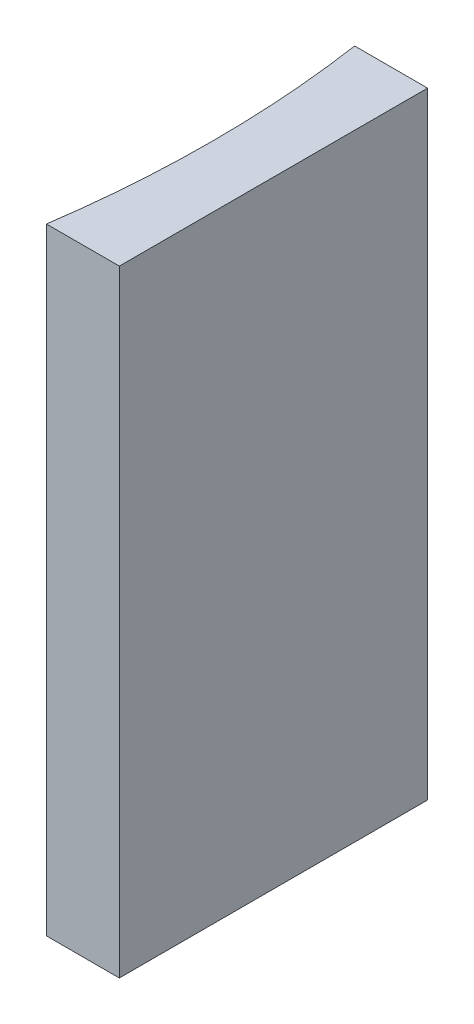
ISO-10303-21;
HEADER;
FILE_DESCRIPTION(('STEP AP214'),'2;1');
FILE_NAME('part.step','',(''),(''),'','','');
FILE_SCHEMA(('AUTOMOTIVE_DESIGN { 1 0 10303 214 1 1 1 1 }'));
ENDSEC;
DATA;
#1=APPLICATION_CONTEXT('core data for automotive mechanical design processes');
#2=APPLICATION_PROTOCOL_DEFINITION('international standard','automotive_design',2000,#1);
#3=PRODUCT_CONTEXT('',#1,'mechanical');
#4=PRODUCT('Part','Part','',(#3));
#5=PRODUCT_RELATED_PRODUCT_CATEGORY('part','',(#4));
#6=PRODUCT_DEFINITION_FORMATION('','',#4);
#7=PRODUCT_DEFINITION_CONTEXT('part definition',#1,'design');
#8=PRODUCT_DEFINITION('design','',#6,#7);
#9=PRODUCT_DEFINITION_SHAPE('','',#8);
#10=(LENGTH_UNIT() NAMED_UNIT(*) SI_UNIT(.MILLI.,.METRE.));
#11=(NAMED_UNIT(*) PLANE_ANGLE_UNIT() SI_UNIT($,.RADIAN.));
#12=(NAMED_UNIT(*) SI_UNIT($,.STERADIAN.) SOLID_ANGLE_UNIT());
#13=UNCERTAINTY_MEASURE_WITH_UNIT(LENGTH_MEASURE(1.E-05),#10,'distance_accuracy_value','');
#14=(GEOMETRIC_REPRESENTATION_CONTEXT(3) GLOBAL_UNCERTAINTY_ASSIGNED_CONTEXT((#13)) GLOBAL_UNIT_ASSIGNED_CONTEXT((#10,
#11,#12)) REPRESENTATION_CONTEXT('',''));
#15=CARTESIAN_POINT('',(0.,0.,0.));
#16=DIRECTION('',(0.,0.,1.));
#17=DIRECTION('',(1.,0.,0.));
#18=AXIS2_PLACEMENT_3D('',#15,#16,#17);
#19=CARTESIAN_POINT('',(0.,20.,0.));
#20=DIRECTION('',(0.,0.,1.));
#21=DIRECTION('',(1.,0.,0.));
#22=AXIS2_PLACEMENT_3D('',#19,#20,#21);
#23=PLANE('',#22);
#24=DIRECTION('',(-1.,0.,0.));
#25=VECTOR('',#24,1.);
#26=CARTESIAN_POINT('',(0.,0.,0.));
#27=LINE('',#26,#25);
#28=CARTESIAN_POINT('',(0.,0.,0.));
#29=VERTEX_POINT('',#28);
#30=CARTESIAN_POINT('',(-2.36584928234928,0.,0.));
#31=VERTEX_POINT('',#30);
#32=EDGE_CURVE('E98',#29,#31,#27,.T.);
#33=ORIENTED_EDGE('',*,*,#32,.T.);
#34=DIRECTION('',(0.,-1.,0.));
#35=VECTOR('',#34,1.);
#36=CARTESIAN_POINT('',(-2.36584928234928,20.,0.));
#37=LINE('',#36,#35);
#38=CARTESIAN_POINT('',(-2.36584928234928,20.,0.));
#39=VERTEX_POINT('',#38);
#40=EDGE_CURVE('E11',#39,#31,#37,.T.);
#41=ORIENTED_EDGE('',*,*,#40,.F.);
#42=DIRECTION('',(-1.,0.,0.));
#43=VECTOR('',#42,1.);
#44=CARTESIAN_POINT('',(0.,20.,0.));
#45=LINE('',#44,#43);
#46=CARTESIAN_POINT('',(0.,20.,0.));
#47=VERTEX_POINT('',#46);
#48=EDGE_CURVE('E86',#47,#39,#45,.T.);
#49=ORIENTED_EDGE('',*,*,#48,.F.);
#50=DIRECTION('',(0.,-1.,0.));
#51=VECTOR('',#50,1.);
#52=CARTESIAN_POINT('',(0.,20.,0.));
#53=LINE('',#52,#51);
#54=EDGE_CURVE('E94',#47,#29,#53,.T.);
#55=ORIENTED_EDGE('',*,*,#54,.T.);
#56=EDGE_LOOP('',(#33,#41,#49,#55));
#57=FACE_BOUND('',#56,.T.);
#58=ADVANCED_FACE('F35',(#57),#23,.F.);
#59=CARTESIAN_POINT('',(-36.35,20.,5.00000000000001));
#60=DIRECTION('',(0.,-1.,0.));
#61=DIRECTION('',(0.,0.,-1.));
#62=AXIS2_PLACEMENT_3D('',#59,#60,#61);
#63=CYLINDRICAL_SURFACE('',#62,34.35);
#64=CARTESIAN_POINT('',(-36.35,0.,5.00000000000001));
#65=DIRECTION('',(0.,-1.,0.));
#66=DIRECTION('',(0.,0.,1.));
#67=AXIS2_PLACEMENT_3D('',#64,#65,#66);
#68=CIRCLE('',#67,34.35);
#69=CARTESIAN_POINT('',(-2.36584928234928,0.,10.));
#70=VERTEX_POINT('',#69);
#71=EDGE_CURVE('E90',#31,#70,#68,.T.);
#72=ORIENTED_EDGE('',*,*,#71,.T.);
#73=DIRECTION('',(0.,-1.,0.));
#74=VECTOR('',#73,1.);
#75=CARTESIAN_POINT('',(-2.36584928234928,20.,10.));
#76=LINE('',#75,#74);
#77=CARTESIAN_POINT('',(-2.36584928234928,20.,10.));
#78=VERTEX_POINT('',#77);
#79=EDGE_CURVE('E43',#78,#70,#76,.T.);
#80=ORIENTED_EDGE('',*,*,#79,.F.);
#81=CARTESIAN_POINT('',(-36.35,20.,5.00000000000001));
#82=DIRECTION('',(0.,-1.,0.));
#83=DIRECTION('',(0.,0.,1.));
#84=AXIS2_PLACEMENT_3D('',#81,#82,#83);
#85=CIRCLE('',#84,34.35);
#86=EDGE_CURVE('E81',#39,#78,#85,.T.);
#87=ORIENTED_EDGE('',*,*,#86,.F.);
#88=ORIENTED_EDGE('',*,*,#40,.T.);
#89=EDGE_LOOP('',(#72,#80,#87,#88));
#90=FACE_BOUND('',#89,.T.);
#91=ADVANCED_FACE('F89',(#90),#63,.F.);
#92=CARTESIAN_POINT('',(0.,20.,10.));
#93=DIRECTION('',(0.,0.,-1.));
#94=DIRECTION('',(-1.,0.,0.));
#95=AXIS2_PLACEMENT_3D('',#92,#93,#94);
#96=PLANE('',#95);
#97=DIRECTION('',(1.,0.,0.));
#98=VECTOR('',#97,1.);
#99=CARTESIAN_POINT('',(0.,0.,10.));
#100=LINE('',#99,#98);
#101=CARTESIAN_POINT('',(0.,0.,10.));
#102=VERTEX_POINT('',#101);
#103=EDGE_CURVE('E68',#70,#102,#100,.T.);
#104=ORIENTED_EDGE('',*,*,#103,.T.);
#105=DIRECTION('',(0.,-1.,0.));
#106=VECTOR('',#105,1.);
#107=CARTESIAN_POINT('',(0.,20.,10.));
#108=LINE('',#107,#106);
#109=CARTESIAN_POINT('',(0.,20.,10.));
#110=VERTEX_POINT('',#109);
#111=EDGE_CURVE('E91',#110,#102,#108,.T.);
#112=ORIENTED_EDGE('',*,*,#111,.F.);
#113=DIRECTION('',(1.,0.,0.));
#114=VECTOR('',#113,1.);
#115=CARTESIAN_POINT('',(0.,20.,10.));
#116=LINE('',#115,#114);
#117=EDGE_CURVE('E84',#78,#110,#116,.T.);
#118=ORIENTED_EDGE('',*,*,#117,.F.);
#119=ORIENTED_EDGE('',*,*,#79,.T.);
#120=EDGE_LOOP('',(#104,#112,#118,#119));
#121=FACE_BOUND('',#120,.T.);
#122=ADVANCED_FACE('F92',(#121),#96,.F.);
#123=CARTESIAN_POINT('',(0.,20.,0.));
#124=DIRECTION('',(-1.,0.,0.));
#125=DIRECTION('',(0.,0.,1.));
#126=AXIS2_PLACEMENT_3D('',#123,#124,#125);
#127=PLANE('',#126);
#128=DIRECTION('',(0.,0.,-1.));
#129=VECTOR('',#128,1.);
#130=CARTESIAN_POINT('',(0.,0.,0.));
#131=LINE('',#130,#129);
#132=EDGE_CURVE('E74',#102,#29,#131,.T.);
#133=ORIENTED_EDGE('',*,*,#132,.T.);
#134=ORIENTED_EDGE('',*,*,#54,.F.);
#135=DIRECTION('',(0.,0.,-1.));
#136=VECTOR('',#135,1.);
#137=CARTESIAN_POINT('',(0.,20.,0.));
#138=LINE('',#137,#136);
#139=EDGE_CURVE('E51',#110,#47,#138,.T.);
#140=ORIENTED_EDGE('',*,*,#139,.F.);
#141=ORIENTED_EDGE('',*,*,#111,.T.);
#142=EDGE_LOOP('',(#133,#134,#140,#141));
#143=FACE_BOUND('',#142,.T.);
#144=ADVANCED_FACE('F105',(#143),#127,.F.);
#145=CARTESIAN_POINT('',(-36.35,20.,5.00000000000001));
#146=DIRECTION('',(0.,1.,0.));
#147=DIRECTION('',(0.,0.,1.));
#148=AXIS2_PLACEMENT_3D('',#145,#146,#147);
#149=PLANE('',#148);
#150=ORIENTED_EDGE('',*,*,#48,.T.);
#151=ORIENTED_EDGE('',*,*,#86,.T.);
#152=ORIENTED_EDGE('',*,*,#117,.T.);
#153=ORIENTED_EDGE('',*,*,#139,.T.);
#154=EDGE_LOOP('',(#150,#151,#152,#153));
#155=FACE_BOUND('',#154,.T.);
#156=ADVANCED_FACE('F82',(#155),#149,.T.);
#157=CARTESIAN_POINT('',(-36.35,0.,5.00000000000001));
#158=DIRECTION('',(0.,1.,0.));
#159=DIRECTION('',(0.,0.,1.));
#160=AXIS2_PLACEMENT_3D('',#157,#158,#159);
#161=PLANE('',#160);
#162=ORIENTED_EDGE('',*,*,#32,.F.);
#163=ORIENTED_EDGE('',*,*,#132,.F.);
#164=ORIENTED_EDGE('',*,*,#103,.F.);
#165=ORIENTED_EDGE('',*,*,#71,.F.);
#166=EDGE_LOOP('',(#162,#163,#164,#165));
#167=FACE_BOUND('',#166,.T.);
#168=ADVANCED_FACE('F108',(#167),#161,.F.);
#169=CLOSED_SHELL('',(#58,#91,#122,#144,#156,#168));
#170=MANIFOLD_SOLID_BREP('B2',#169);
#171=ADVANCED_BREP_SHAPE_REPRESENTATION('',(#18,#170),#14);
#172=SHAPE_DEFINITION_REPRESENTATION(#9,#171);
ENDSEC;
END-ISO-10303-21;
